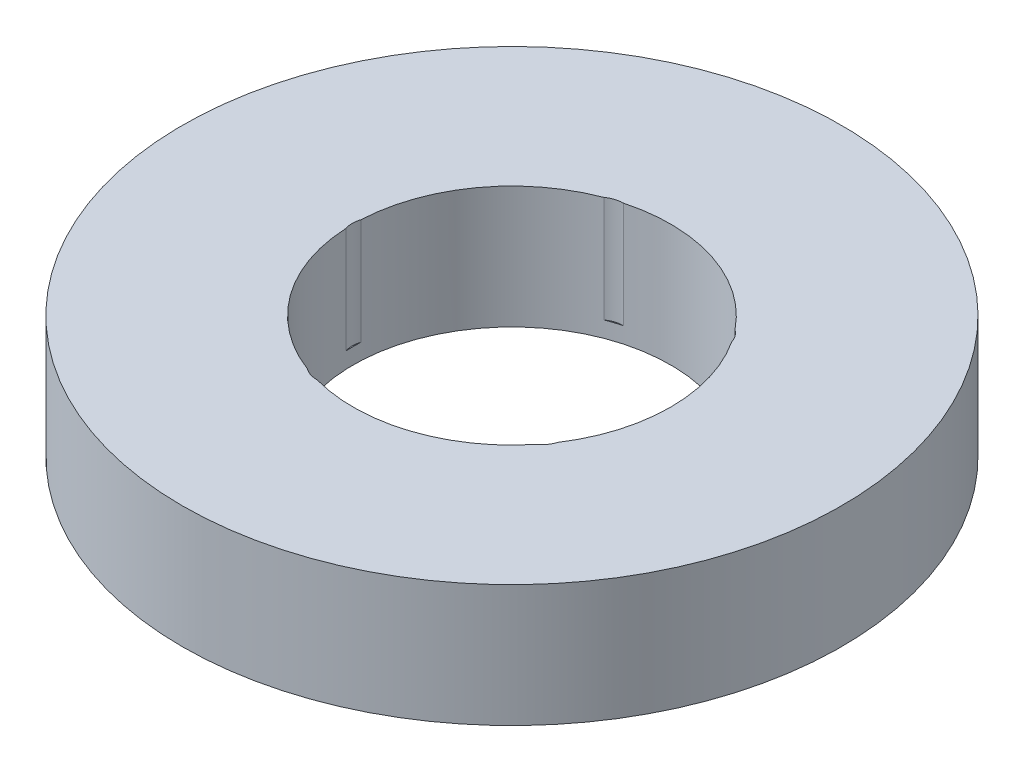
ISO-10303-21;
HEADER;
FILE_DESCRIPTION(('STEP AP214'),'2;1');
FILE_NAME('part.step','',(''),(''),'','','');
FILE_SCHEMA(('AUTOMOTIVE_DESIGN { 1 0 10303 214 1 1 1 1 }'));
ENDSEC;
DATA;
#1=APPLICATION_CONTEXT('core data for automotive mechanical design processes');
#2=APPLICATION_PROTOCOL_DEFINITION('international standard','automotive_design',2000,#1);
#3=PRODUCT_CONTEXT('',#1,'mechanical');
#4=PRODUCT('Part','Part','',(#3));
#5=PRODUCT_RELATED_PRODUCT_CATEGORY('part','',(#4));
#6=PRODUCT_DEFINITION_FORMATION('','',#4);
#7=PRODUCT_DEFINITION_CONTEXT('part definition',#1,'design');
#8=PRODUCT_DEFINITION('design','',#6,#7);
#9=PRODUCT_DEFINITION_SHAPE('','',#8);
#10=(LENGTH_UNIT() NAMED_UNIT(*) SI_UNIT(.MILLI.,.METRE.));
#11=(NAMED_UNIT(*) PLANE_ANGLE_UNIT() SI_UNIT($,.RADIAN.));
#12=(NAMED_UNIT(*) SI_UNIT($,.STERADIAN.) SOLID_ANGLE_UNIT());
#13=UNCERTAINTY_MEASURE_WITH_UNIT(LENGTH_MEASURE(1.E-05),#10,'distance_accuracy_value','');
#14=(GEOMETRIC_REPRESENTATION_CONTEXT(3) GLOBAL_UNCERTAINTY_ASSIGNED_CONTEXT((#13)) GLOBAL_UNIT_ASSIGNED_CONTEXT((#10,
#11,#12)) REPRESENTATION_CONTEXT('',''));
#15=CARTESIAN_POINT('',(0.,0.,0.));
#16=DIRECTION('',(0.,0.,1.));
#17=DIRECTION('',(1.,0.,0.));
#18=AXIS2_PLACEMENT_3D('',#15,#16,#17);
#19=CARTESIAN_POINT('',(0.,25.,0.));
#20=DIRECTION('',(0.,-1.,0.));
#21=DIRECTION('',(0.,0.,-1.));
#22=AXIS2_PLACEMENT_3D('',#19,#20,#21);
#23=CYLINDRICAL_SURFACE('',#22,67.5);
#24=CARTESIAN_POINT('',(0.,25.,0.));
#25=DIRECTION('',(0.,1.,0.));
#26=DIRECTION('',(0.,0.,1.));
#27=AXIS2_PLACEMENT_3D('',#24,#25,#26);
#28=CIRCLE('',#27,67.5);
#29=CARTESIAN_POINT('',(0.,25.,67.5));
#30=VERTEX_POINT('',#29);
#31=EDGE_CURVE('E159',#30,#30,#28,.T.);
#32=ORIENTED_EDGE('',*,*,#31,.F.);
#33=EDGE_LOOP('',(#32));
#34=FACE_BOUND('',#33,.T.);
#35=CARTESIAN_POINT('',(0.,0.,0.));
#36=DIRECTION('',(0.,1.,0.));
#37=DIRECTION('',(0.,0.,1.));
#38=AXIS2_PLACEMENT_3D('',#35,#36,#37);
#39=CIRCLE('',#38,67.5);
#40=CARTESIAN_POINT('',(0.,0.,67.5));
#41=VERTEX_POINT('',#40);
#42=EDGE_CURVE('E152',#41,#41,#39,.T.);
#43=ORIENTED_EDGE('',*,*,#42,.T.);
#44=EDGE_LOOP('',(#43));
#45=FACE_BOUND('',#44,.T.);
#46=ADVANCED_FACE('F39',(#34,#45),#23,.T.);
#47=CARTESIAN_POINT('',(0.,25.,0.));
#48=DIRECTION('',(0.,1.,0.));
#49=DIRECTION('',(0.,0.,1.));
#50=AXIS2_PLACEMENT_3D('',#47,#48,#49);
#51=PLANE('',#50);
#52=CARTESIAN_POINT('',(-8.5797992507578,25.,26.4059069063261));
#53=DIRECTION('',(0.,1.,0.));
#54=DIRECTION('',(0.951056516295155,0.,0.309016994374945));
#55=AXIS2_PLACEMENT_3D('',#52,#53,#54);
#56=CIRCLE('',#55,4.95114463579329);
#57=CARTESIAN_POINT('',(-11.5191933733673,25.,30.3901000989956));
#58=VERTEX_POINT('',#57);
#59=CARTESIAN_POINT('',(-8.54362945333606,25.,31.3569194240137));
#60=VERTEX_POINT('',#59);
#61=EDGE_CURVE('E192',#58,#60,#56,.T.);
#62=ORIENTED_EDGE('',*,*,#61,.F.);
#63=CARTESIAN_POINT('',(0.,25.,0.));
#64=DIRECTION('',(0.,1.,0.));
#65=DIRECTION('',(0.,0.,1.));
#66=AXIS2_PLACEMENT_3D('',#63,#64,#65);
#67=CIRCLE('',#66,32.5);
#68=CARTESIAN_POINT('',(-32.4623292438735,25.,1.56434652885955));
#69=VERTEX_POINT('',#68);
#70=EDGE_CURVE('E147',#69,#58,#67,.T.);
#71=ORIENTED_EDGE('',*,*,#70,.F.);
#72=CARTESIAN_POINT('',(-27.7648136087543,25.,0.));
#73=DIRECTION('',(0.,1.,0.));
#74=DIRECTION('',(0.,0.,1.));
#75=AXIS2_PLACEMENT_3D('',#72,#73,#74);
#76=CIRCLE('',#75,4.95114463579329);
#77=CARTESIAN_POINT('',(-32.4623292438735,25.,-1.56434652885955));
#78=VERTEX_POINT('',#77);
#79=EDGE_CURVE('E154',#78,#69,#76,.T.);
#80=ORIENTED_EDGE('',*,*,#79,.F.);
#81=CARTESIAN_POINT('',(-11.5191933733677,25.,-30.3901000989954));
#82=VERTEX_POINT('',#81);
#83=EDGE_CURVE('E136',#82,#78,#67,.T.);
#84=ORIENTED_EDGE('',*,*,#83,.F.);
#85=CARTESIAN_POINT('',(-8.57979925075818,25.,-26.405906906326));
#86=DIRECTION('',(0.,1.,0.));
#87=DIRECTION('',(-0.95105651629515,0.,0.309016994374958));
#88=AXIS2_PLACEMENT_3D('',#85,#86,#87);
#89=CIRCLE('',#88,4.95114463579329);
#90=CARTESIAN_POINT('',(-8.54362945333653,25.,-31.3569194240136));
#91=VERTEX_POINT('',#90);
#92=EDGE_CURVE('E117',#91,#82,#89,.T.);
#93=ORIENTED_EDGE('',*,*,#92,.F.);
#94=CARTESIAN_POINT('',(25.3430762161498,25.,-20.3464613115506));
#95=VERTEX_POINT('',#94);
#96=EDGE_CURVE('E133',#95,#91,#67,.T.);
#97=ORIENTED_EDGE('',*,*,#96,.F.);
#98=CARTESIAN_POINT('',(22.4622060551349,25.,-16.3197479718753));
#99=DIRECTION('',(0.,1.,0.));
#100=DIRECTION('',(-0.58778525229248,0.,-0.809016994374942));
#101=AXIS2_PLACEMENT_3D('',#98,#99,#100);
#102=CIRCLE('',#101,4.95114463579329);
#103=CARTESIAN_POINT('',(27.1820758544269,25.,-17.8152954576729));
#104=VERTEX_POINT('',#103);
#105=EDGE_CURVE('E333',#104,#95,#102,.T.);
#106=ORIENTED_EDGE('',*,*,#105,.F.);
#107=CARTESIAN_POINT('',(27.1820758544272,25.,17.8152954576725));
#108=VERTEX_POINT('',#107);
#109=EDGE_CURVE('E144',#108,#104,#67,.T.);
#110=ORIENTED_EDGE('',*,*,#109,.F.);
#111=CARTESIAN_POINT('',(22.4622060551351,25.,16.319747971875));
#112=DIRECTION('',(0.,1.,0.));
#113=DIRECTION('',(0.587785252292469,0.,-0.809016994374951));
#114=AXIS2_PLACEMENT_3D('',#111,#112,#113);
#115=CIRCLE('',#114,4.95114463579329);
#116=CARTESIAN_POINT('',(25.3430762161501,25.,20.3464613115502));
#117=VERTEX_POINT('',#116);
#118=EDGE_CURVE('E328',#117,#108,#115,.T.);
#119=ORIENTED_EDGE('',*,*,#118,.F.);
#120=EDGE_CURVE('E146',#60,#117,#67,.T.);
#121=ORIENTED_EDGE('',*,*,#120,.F.);
#122=EDGE_LOOP('',(#62,#71,#80,#84,#93,#97,#106,#110,#119,#121));
#123=FACE_BOUND('',#122,.T.);
#124=ORIENTED_EDGE('',*,*,#31,.T.);
#125=EDGE_LOOP('',(#124));
#126=FACE_BOUND('',#125,.T.);
#127=ADVANCED_FACE('F131',(#123,#126),#51,.T.);
#128=CARTESIAN_POINT('',(0.,0.,0.));
#129=DIRECTION('',(0.,1.,0.));
#130=DIRECTION('',(0.,0.,1.));
#131=AXIS2_PLACEMENT_3D('',#128,#129,#130);
#132=PLANE('',#131);
#133=CARTESIAN_POINT('',(0.,0.,0.));
#134=DIRECTION('',(0.,1.,0.));
#135=DIRECTION('',(0.,0.,1.));
#136=AXIS2_PLACEMENT_3D('',#133,#134,#135);
#137=CIRCLE('',#136,32.5);
#138=CARTESIAN_POINT('',(0.,0.,32.5));
#139=VERTEX_POINT('',#138);
#140=EDGE_CURVE('E149',#139,#139,#137,.T.);
#141=ORIENTED_EDGE('',*,*,#140,.T.);
#142=EDGE_LOOP('',(#141));
#143=FACE_BOUND('',#142,.T.);
#144=ORIENTED_EDGE('',*,*,#42,.F.);
#145=EDGE_LOOP('',(#144));
#146=FACE_BOUND('',#145,.T.);
#147=ADVANCED_FACE('F209',(#143,#146),#132,.F.);
#148=CARTESIAN_POINT('',(0.,25.,0.));
#149=DIRECTION('',(0.,-1.,0.));
#150=DIRECTION('',(0.,0.,-1.));
#151=AXIS2_PLACEMENT_3D('',#148,#149,#150);
#152=CYLINDRICAL_SURFACE('',#151,32.5);
#153=DIRECTION('',(0.,1.,0.));
#154=VECTOR('',#153,1.);
#155=CARTESIAN_POINT('',(-11.5191933733672,14.1311515003588,30.3901000989956));
#156=LINE('',#155,#154);
#157=CARTESIAN_POINT('',(-11.5191933733673,3.26230300071757,30.3901000989956));
#158=VERTEX_POINT('',#157);
#159=EDGE_CURVE('E11',#158,#58,#156,.T.);
#160=ORIENTED_EDGE('',*,*,#159,.F.);
#161=CARTESIAN_POINT('',(0.,3.26230300071757,0.));
#162=DIRECTION('',(0.,1.,0.));
#163=DIRECTION('',(0.,0.,1.));
#164=AXIS2_PLACEMENT_3D('',#161,#162,#163);
#165=CIRCLE('',#164,32.5);
#166=CARTESIAN_POINT('',(-8.54362945333606,3.26230300071757,31.3569194240137));
#167=VERTEX_POINT('',#166);
#168=EDGE_CURVE('E187',#158,#167,#165,.T.);
#169=ORIENTED_EDGE('',*,*,#168,.T.);
#170=DIRECTION('',(0.,1.,0.));
#171=VECTOR('',#170,1.);
#172=CARTESIAN_POINT('',(-8.54362945333611,14.1311515003588,31.3569194240137));
#173=LINE('',#172,#171);
#174=EDGE_CURVE('E46',#60,#167,#173,.F.);
#175=ORIENTED_EDGE('',*,*,#174,.F.);
#176=ORIENTED_EDGE('',*,*,#120,.T.);
#177=DIRECTION('',(0.,1.,0.));
#178=VECTOR('',#177,1.);
#179=CARTESIAN_POINT('',(25.3430762161501,14.1311515003588,20.3464613115502));
#180=LINE('',#179,#178);
#181=CARTESIAN_POINT('',(25.3430762161501,3.26230300071757,20.3464613115502));
#182=VERTEX_POINT('',#181);
#183=EDGE_CURVE('E186',#182,#117,#180,.T.);
#184=ORIENTED_EDGE('',*,*,#183,.F.);
#185=CARTESIAN_POINT('',(0.,3.26230300071757,0.));
#186=DIRECTION('',(0.,1.,0.));
#187=DIRECTION('',(0.,0.,1.));
#188=AXIS2_PLACEMENT_3D('',#185,#186,#187);
#189=CIRCLE('',#188,32.5);
#190=CARTESIAN_POINT('',(27.1820758544272,3.26230300071757,17.8152954576725));
#191=VERTEX_POINT('',#190);
#192=EDGE_CURVE('E182',#182,#191,#189,.T.);
#193=ORIENTED_EDGE('',*,*,#192,.T.);
#194=DIRECTION('',(0.,1.,0.));
#195=VECTOR('',#194,1.);
#196=CARTESIAN_POINT('',(27.1820758544272,14.1311515003588,17.8152954576726));
#197=LINE('',#196,#195);
#198=EDGE_CURVE('E184',#108,#191,#197,.F.);
#199=ORIENTED_EDGE('',*,*,#198,.F.);
#200=ORIENTED_EDGE('',*,*,#109,.T.);
#201=DIRECTION('',(0.,1.,0.));
#202=VECTOR('',#201,1.);
#203=CARTESIAN_POINT('',(27.1820758544269,14.1311515003588,-17.815295457673));
#204=LINE('',#203,#202);
#205=CARTESIAN_POINT('',(27.1820758544269,3.26230300071757,-17.8152954576729));
#206=VERTEX_POINT('',#205);
#207=EDGE_CURVE('E178',#206,#104,#204,.T.);
#208=ORIENTED_EDGE('',*,*,#207,.F.);
#209=CARTESIAN_POINT('',(0.,3.26230300071757,0.));
#210=DIRECTION('',(0.,1.,0.));
#211=DIRECTION('',(0.,0.,1.));
#212=AXIS2_PLACEMENT_3D('',#209,#210,#211);
#213=CIRCLE('',#212,32.5);
#214=CARTESIAN_POINT('',(25.3430762161498,3.26230300071757,-20.3464613115506));
#215=VERTEX_POINT('',#214);
#216=EDGE_CURVE('E123',#206,#215,#213,.T.);
#217=ORIENTED_EDGE('',*,*,#216,.T.);
#218=DIRECTION('',(0.,1.,0.));
#219=VECTOR('',#218,1.);
#220=CARTESIAN_POINT('',(25.3430762161498,14.1311515003588,-20.3464613115506));
#221=LINE('',#220,#219);
#222=EDGE_CURVE('E145',#95,#215,#221,.F.);
#223=ORIENTED_EDGE('',*,*,#222,.F.);
#224=ORIENTED_EDGE('',*,*,#96,.T.);
#225=DIRECTION('',(0.,1.,0.));
#226=VECTOR('',#225,1.);
#227=CARTESIAN_POINT('',(-8.54362945333656,14.1311515003588,-31.3569194240136));
#228=LINE('',#227,#226);
#229=CARTESIAN_POINT('',(-8.54362945333653,3.26230300071757,-31.3569194240136));
#230=VERTEX_POINT('',#229);
#231=EDGE_CURVE('E111',#230,#91,#228,.T.);
#232=ORIENTED_EDGE('',*,*,#231,.F.);
#233=CARTESIAN_POINT('',(0.,3.26230300071757,0.));
#234=DIRECTION('',(0.,1.,0.));
#235=DIRECTION('',(0.,0.,1.));
#236=AXIS2_PLACEMENT_3D('',#233,#234,#235);
#237=CIRCLE('',#236,32.5);
#238=CARTESIAN_POINT('',(-11.5191933733677,3.26230300071757,-30.3901000989954));
#239=VERTEX_POINT('',#238);
#240=EDGE_CURVE('E173',#230,#239,#237,.T.);
#241=ORIENTED_EDGE('',*,*,#240,.T.);
#242=DIRECTION('',(0.,1.,0.));
#243=VECTOR('',#242,1.);
#244=CARTESIAN_POINT('',(-11.5191933733676,14.1311515003588,-30.3901000989955));
#245=LINE('',#244,#243);
#246=EDGE_CURVE('E124',#82,#239,#245,.F.);
#247=ORIENTED_EDGE('',*,*,#246,.F.);
#248=ORIENTED_EDGE('',*,*,#83,.T.);
#249=DIRECTION('',(0.,1.,0.));
#250=VECTOR('',#249,1.);
#251=CARTESIAN_POINT('',(-32.4623292438735,14.1311515003588,-1.56434652885952));
#252=LINE('',#251,#250);
#253=CARTESIAN_POINT('',(-32.4623292438735,3.26230300071757,-1.56434652885955));
#254=VERTEX_POINT('',#253);
#255=EDGE_CURVE('E171',#254,#78,#252,.T.);
#256=ORIENTED_EDGE('',*,*,#255,.F.);
#257=CARTESIAN_POINT('',(0.,3.26230300071757,0.));
#258=DIRECTION('',(0.,1.,0.));
#259=DIRECTION('',(0.,0.,1.));
#260=AXIS2_PLACEMENT_3D('',#257,#258,#259);
#261=CIRCLE('',#260,32.5);
#262=CARTESIAN_POINT('',(-32.4623292438735,3.26230300071757,1.56434652885955));
#263=VERTEX_POINT('',#262);
#264=EDGE_CURVE('E162',#254,#263,#261,.T.);
#265=ORIENTED_EDGE('',*,*,#264,.T.);
#266=DIRECTION('',(0.,1.,0.));
#267=VECTOR('',#266,1.);
#268=CARTESIAN_POINT('',(-32.4623292438735,14.1311515003588,1.56434652885952));
#269=LINE('',#268,#267);
#270=EDGE_CURVE('E169',#69,#263,#269,.F.);
#271=ORIENTED_EDGE('',*,*,#270,.F.);
#272=ORIENTED_EDGE('',*,*,#70,.T.);
#273=EDGE_LOOP('',(#160,#169,#175,#176,#184,#193,#199,#200,#208,#217,#223,#224,#232,#241,#247,
#248,#256,#265,#271,#272));
#274=FACE_BOUND('',#273,.T.);
#275=ORIENTED_EDGE('',*,*,#140,.F.);
#276=EDGE_LOOP('',(#275));
#277=FACE_BOUND('',#276,.T.);
#278=ADVANCED_FACE('F139',(#274,#277),#152,.F.);
#279=CARTESIAN_POINT('',(-27.7648136087543,3.26230300071757,0.));
#280=DIRECTION('',(0.,1.,0.));
#281=DIRECTION('',(0.,0.,1.));
#282=AXIS2_PLACEMENT_3D('',#279,#280,#281);
#283=CYLINDRICAL_SURFACE('',#282,4.95114463579329);
#284=ORIENTED_EDGE('',*,*,#255,.T.);
#285=ORIENTED_EDGE('',*,*,#79,.T.);
#286=ORIENTED_EDGE('',*,*,#270,.T.);
#287=CARTESIAN_POINT('',(-27.7648136087543,3.26230300071757,0.));
#288=DIRECTION('',(0.,1.,0.));
#289=DIRECTION('',(0.,0.,1.));
#290=AXIS2_PLACEMENT_3D('',#287,#288,#289);
#291=CIRCLE('',#290,4.95114463579329);
#292=EDGE_CURVE('E157',#254,#263,#291,.T.);
#293=ORIENTED_EDGE('',*,*,#292,.F.);
#294=EDGE_LOOP('',(#284,#285,#286,#293));
#295=FACE_BOUND('',#294,.T.);
#296=ADVANCED_FACE('F222',(#295),#283,.F.);
#297=CARTESIAN_POINT('',(-27.7648136087543,3.26230300071757,0.));
#298=DIRECTION('',(0.,1.,0.));
#299=DIRECTION('',(0.,0.,1.));
#300=AXIS2_PLACEMENT_3D('',#297,#298,#299);
#301=PLANE('',#300);
#302=ORIENTED_EDGE('',*,*,#292,.T.);
#303=ORIENTED_EDGE('',*,*,#264,.F.);
#304=EDGE_LOOP('',(#302,#303));
#305=FACE_BOUND('',#304,.T.);
#306=ADVANCED_FACE('F223',(#305),#301,.T.);
#307=CARTESIAN_POINT('',(-8.57979925075818,3.26230300071757,-26.405906906326));
#308=DIRECTION('',(0.,1.,0.));
#309=DIRECTION('',(0.,0.,1.));
#310=AXIS2_PLACEMENT_3D('',#307,#308,#309);
#311=CYLINDRICAL_SURFACE('',#310,4.95114463579329);
#312=ORIENTED_EDGE('',*,*,#231,.T.);
#313=ORIENTED_EDGE('',*,*,#92,.T.);
#314=ORIENTED_EDGE('',*,*,#246,.T.);
#315=CARTESIAN_POINT('',(-8.57979925075818,3.26230300071757,-26.405906906326));
#316=DIRECTION('',(0.,1.,0.));
#317=DIRECTION('',(-0.95105651629515,0.,0.309016994374958));
#318=AXIS2_PLACEMENT_3D('',#315,#316,#317);
#319=CIRCLE('',#318,4.95114463579329);
#320=EDGE_CURVE('E119',#230,#239,#319,.T.);
#321=ORIENTED_EDGE('',*,*,#320,.F.);
#322=EDGE_LOOP('',(#312,#313,#314,#321));
#323=FACE_BOUND('',#322,.T.);
#324=ADVANCED_FACE('F116',(#323),#311,.F.);
#325=CARTESIAN_POINT('',(-8.57979925075818,3.26230300071757,-26.405906906326));
#326=DIRECTION('',(0.,1.,0.));
#327=DIRECTION('',(-0.95105651629515,0.,0.309016994374958));
#328=AXIS2_PLACEMENT_3D('',#325,#326,#327);
#329=PLANE('',#328);
#330=ORIENTED_EDGE('',*,*,#320,.T.);
#331=ORIENTED_EDGE('',*,*,#240,.F.);
#332=EDGE_LOOP('',(#330,#331));
#333=FACE_BOUND('',#332,.T.);
#334=ADVANCED_FACE('F235',(#333),#329,.T.);
#335=CARTESIAN_POINT('',(22.4622060551349,3.26230300071757,-16.3197479718753));
#336=DIRECTION('',(0.,1.,0.));
#337=DIRECTION('',(0.,0.,1.));
#338=AXIS2_PLACEMENT_3D('',#335,#336,#337);
#339=CYLINDRICAL_SURFACE('',#338,4.95114463579329);
#340=ORIENTED_EDGE('',*,*,#207,.T.);
#341=ORIENTED_EDGE('',*,*,#105,.T.);
#342=ORIENTED_EDGE('',*,*,#222,.T.);
#343=CARTESIAN_POINT('',(22.4622060551349,3.26230300071757,-16.3197479718753));
#344=DIRECTION('',(0.,1.,0.));
#345=DIRECTION('',(-0.58778525229248,0.,-0.809016994374942));
#346=AXIS2_PLACEMENT_3D('',#343,#344,#345);
#347=CIRCLE('',#346,4.95114463579329);
#348=EDGE_CURVE('E335',#206,#215,#347,.T.);
#349=ORIENTED_EDGE('',*,*,#348,.F.);
#350=EDGE_LOOP('',(#340,#341,#342,#349));
#351=FACE_BOUND('',#350,.T.);
#352=ADVANCED_FACE('F234',(#351),#339,.F.);
#353=CARTESIAN_POINT('',(22.4622060551349,3.26230300071757,-16.3197479718753));
#354=DIRECTION('',(0.,1.,0.));
#355=DIRECTION('',(-0.58778525229248,0.,-0.809016994374942));
#356=AXIS2_PLACEMENT_3D('',#353,#354,#355);
#357=PLANE('',#356);
#358=ORIENTED_EDGE('',*,*,#348,.T.);
#359=ORIENTED_EDGE('',*,*,#216,.F.);
#360=EDGE_LOOP('',(#358,#359));
#361=FACE_BOUND('',#360,.T.);
#362=ADVANCED_FACE('F239',(#361),#357,.T.);
#363=CARTESIAN_POINT('',(22.4622060551351,3.26230300071757,16.319747971875));
#364=DIRECTION('',(0.,1.,0.));
#365=DIRECTION('',(0.,0.,1.));
#366=AXIS2_PLACEMENT_3D('',#363,#364,#365);
#367=CYLINDRICAL_SURFACE('',#366,4.95114463579329);
#368=ORIENTED_EDGE('',*,*,#183,.T.);
#369=ORIENTED_EDGE('',*,*,#118,.T.);
#370=ORIENTED_EDGE('',*,*,#198,.T.);
#371=CARTESIAN_POINT('',(22.4622060551351,3.26230300071757,16.319747971875));
#372=DIRECTION('',(0.,1.,0.));
#373=DIRECTION('',(0.587785252292469,0.,-0.809016994374951));
#374=AXIS2_PLACEMENT_3D('',#371,#372,#373);
#375=CIRCLE('',#374,4.95114463579329);
#376=EDGE_CURVE('E56',#182,#191,#375,.T.);
#377=ORIENTED_EDGE('',*,*,#376,.F.);
#378=EDGE_LOOP('',(#368,#369,#370,#377));
#379=FACE_BOUND('',#378,.T.);
#380=ADVANCED_FACE('F242',(#379),#367,.F.);
#381=CARTESIAN_POINT('',(22.4622060551351,3.26230300071757,16.319747971875));
#382=DIRECTION('',(0.,1.,0.));
#383=DIRECTION('',(0.587785252292469,0.,-0.809016994374951));
#384=AXIS2_PLACEMENT_3D('',#381,#382,#383);
#385=PLANE('',#384);
#386=ORIENTED_EDGE('',*,*,#376,.T.);
#387=ORIENTED_EDGE('',*,*,#192,.F.);
#388=EDGE_LOOP('',(#386,#387));
#389=FACE_BOUND('',#388,.T.);
#390=ADVANCED_FACE('F205',(#389),#385,.T.);
#391=CARTESIAN_POINT('',(-8.5797992507578,3.26230300071757,26.4059069063261));
#392=DIRECTION('',(0.,1.,0.));
#393=DIRECTION('',(0.,0.,1.));
#394=AXIS2_PLACEMENT_3D('',#391,#392,#393);
#395=CYLINDRICAL_SURFACE('',#394,4.95114463579329);
#396=ORIENTED_EDGE('',*,*,#159,.T.);
#397=ORIENTED_EDGE('',*,*,#61,.T.);
#398=ORIENTED_EDGE('',*,*,#174,.T.);
#399=CARTESIAN_POINT('',(-8.5797992507578,3.26230300071757,26.4059069063261));
#400=DIRECTION('',(0.,1.,0.));
#401=DIRECTION('',(0.951056516295155,0.,0.309016994374945));
#402=AXIS2_PLACEMENT_3D('',#399,#400,#401);
#403=CIRCLE('',#402,4.95114463579329);
#404=EDGE_CURVE('E55',#158,#167,#403,.T.);
#405=ORIENTED_EDGE('',*,*,#404,.F.);
#406=EDGE_LOOP('',(#396,#397,#398,#405));
#407=FACE_BOUND('',#406,.T.);
#408=ADVANCED_FACE('F195',(#407),#395,.F.);
#409=CARTESIAN_POINT('',(-8.5797992507578,3.26230300071757,26.4059069063261));
#410=DIRECTION('',(0.,1.,0.));
#411=DIRECTION('',(0.951056516295155,0.,0.309016994374945));
#412=AXIS2_PLACEMENT_3D('',#409,#410,#411);
#413=PLANE('',#412);
#414=ORIENTED_EDGE('',*,*,#404,.T.);
#415=ORIENTED_EDGE('',*,*,#168,.F.);
#416=EDGE_LOOP('',(#414,#415));
#417=FACE_BOUND('',#416,.T.);
#418=ADVANCED_FACE('F198',(#417),#413,.T.);
#419=CLOSED_SHELL('',(#46,#127,#147,#278,#296,#306,#324,#334,#352,#362,#380,#390,#408,#418));
#420=MANIFOLD_SOLID_BREP('B2',#419);
#421=ADVANCED_BREP_SHAPE_REPRESENTATION('',(#18,#420),#14);
#422=SHAPE_DEFINITION_REPRESENTATION(#9,#421);
ENDSEC;
END-ISO-10303-21;
